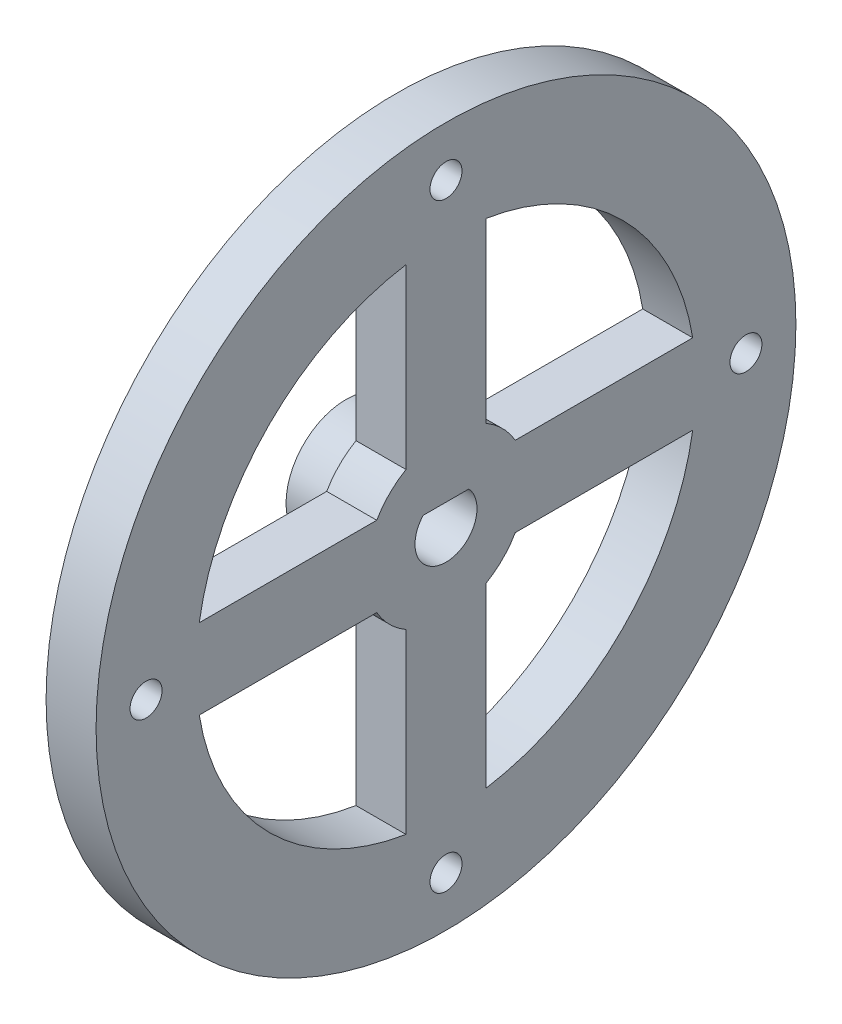
ISO-10303-21;
HEADER;
FILE_DESCRIPTION(('STEP AP214'),'2;1');
FILE_NAME('part.step','',(''),(''),'','','');
FILE_SCHEMA(('AUTOMOTIVE_DESIGN { 1 0 10303 214 1 1 1 1 }'));
ENDSEC;
DATA;
#1=APPLICATION_CONTEXT('core data for automotive mechanical design processes');
#2=APPLICATION_PROTOCOL_DEFINITION('international standard','automotive_design',2000,#1);
#3=PRODUCT_CONTEXT('',#1,'mechanical');
#4=PRODUCT('Part','Part','',(#3));
#5=PRODUCT_RELATED_PRODUCT_CATEGORY('part','',(#4));
#6=PRODUCT_DEFINITION_FORMATION('','',#4);
#7=PRODUCT_DEFINITION_CONTEXT('part definition',#1,'design');
#8=PRODUCT_DEFINITION('design','',#6,#7);
#9=PRODUCT_DEFINITION_SHAPE('','',#8);
#10=(LENGTH_UNIT() NAMED_UNIT(*) SI_UNIT(.MILLI.,.METRE.));
#11=(NAMED_UNIT(*) PLANE_ANGLE_UNIT() SI_UNIT($,.RADIAN.));
#12=(NAMED_UNIT(*) SI_UNIT($,.STERADIAN.) SOLID_ANGLE_UNIT());
#13=UNCERTAINTY_MEASURE_WITH_UNIT(LENGTH_MEASURE(1.E-05),#10,'distance_accuracy_value','');
#14=(GEOMETRIC_REPRESENTATION_CONTEXT(3) GLOBAL_UNCERTAINTY_ASSIGNED_CONTEXT((#13)) GLOBAL_UNIT_ASSIGNED_CONTEXT((#10,
#11,#12)) REPRESENTATION_CONTEXT('',''));
#15=CARTESIAN_POINT('',(0.,0.,0.));
#16=DIRECTION('',(0.,0.,1.));
#17=DIRECTION('',(1.,0.,0.));
#18=AXIS2_PLACEMENT_3D('',#15,#16,#17);
#19=CARTESIAN_POINT('',(5.,0.,0.));
#20=DIRECTION('',(-1.,0.,0.));
#21=DIRECTION('',(0.,0.,1.));
#22=AXIS2_PLACEMENT_3D('',#19,#20,#21);
#23=CYLINDRICAL_SURFACE('',#22,3.1);
#24=DIRECTION('',(-1.,0.,0.));
#25=VECTOR('',#24,1.);
#26=CARTESIAN_POINT('',(5.,2.1,-2.28035085019828));
#27=LINE('',#26,#25);
#28=CARTESIAN_POINT('',(5.,2.1,-2.28035085019828));
#29=VERTEX_POINT('',#28);
#30=CARTESIAN_POINT('',(-2.6124,2.1,-2.28035085019828));
#31=VERTEX_POINT('',#30);
#32=EDGE_CURVE('E487',#29,#31,#27,.T.);
#33=ORIENTED_EDGE('',*,*,#32,.T.);
#34=CARTESIAN_POINT('',(-2.6124,0.,0.));
#35=DIRECTION('',(-1.,0.,0.));
#36=DIRECTION('',(0.,0.,1.));
#37=AXIS2_PLACEMENT_3D('',#34,#35,#36);
#38=CIRCLE('',#37,3.1);
#39=CARTESIAN_POINT('',(-2.6124,2.1,2.28035085019828));
#40=VERTEX_POINT('',#39);
#41=EDGE_CURVE('E64',#31,#40,#38,.T.);
#42=ORIENTED_EDGE('',*,*,#41,.T.);
#43=DIRECTION('',(-1.,0.,0.));
#44=VECTOR('',#43,1.);
#45=CARTESIAN_POINT('',(5.,2.1,2.28035085019828));
#46=LINE('',#45,#44);
#47=CARTESIAN_POINT('',(5.,2.1,2.28035085019828));
#48=VERTEX_POINT('',#47);
#49=EDGE_CURVE('E483',#48,#40,#46,.T.);
#50=ORIENTED_EDGE('',*,*,#49,.F.);
#51=CARTESIAN_POINT('',(5.,0.,0.));
#52=DIRECTION('',(1.,0.,0.));
#53=DIRECTION('',(0.,0.,-1.));
#54=AXIS2_PLACEMENT_3D('',#51,#52,#53);
#55=CIRCLE('',#54,3.1);
#56=EDGE_CURVE('E476',#48,#29,#55,.T.);
#57=ORIENTED_EDGE('',*,*,#56,.T.);
#58=EDGE_LOOP('',(#33,#42,#50,#57));
#59=FACE_BOUND('',#58,.T.);
#60=ADVANCED_FACE('F49',(#59),#23,.F.);
#61=CARTESIAN_POINT('',(5.,2.1,-2.28035085019828));
#62=DIRECTION('',(0.,-1.,0.));
#63=DIRECTION('',(0.,0.,-1.));
#64=AXIS2_PLACEMENT_3D('',#61,#62,#63);
#65=PLANE('',#64);
#66=ORIENTED_EDGE('',*,*,#49,.T.);
#67=DIRECTION('',(0.,0.,-1.));
#68=VECTOR('',#67,1.);
#69=CARTESIAN_POINT('',(-2.6124,2.1,-2.28035085019828));
#70=LINE('',#69,#68);
#71=EDGE_CURVE('E11',#40,#31,#70,.T.);
#72=ORIENTED_EDGE('',*,*,#71,.T.);
#73=ORIENTED_EDGE('',*,*,#32,.F.);
#74=DIRECTION('',(0.,0.,1.));
#75=VECTOR('',#74,1.);
#76=CARTESIAN_POINT('',(5.,2.1,-2.28035085019828));
#77=LINE('',#76,#75);
#78=EDGE_CURVE('E480',#29,#48,#77,.T.);
#79=ORIENTED_EDGE('',*,*,#78,.T.);
#80=EDGE_LOOP('',(#66,#72,#73,#79));
#81=FACE_BOUND('',#80,.T.);
#82=ADVANCED_FACE('F531',(#81),#65,.T.);
#83=CARTESIAN_POINT('',(-5.,0.,0.));
#84=DIRECTION('',(-1.,0.,0.));
#85=DIRECTION('',(0.,0.,1.));
#86=AXIS2_PLACEMENT_3D('',#83,#84,#85);
#87=PLANE('',#86);
#88=CARTESIAN_POINT('',(-5.,0.,0.));
#89=DIRECTION('',(-1.,0.,0.));
#90=DIRECTION('',(0.,0.,1.));
#91=AXIS2_PLACEMENT_3D('',#88,#89,#90);
#92=CIRCLE('',#91,6.);
#93=CARTESIAN_POINT('',(-5.,0.,6.));
#94=VERTEX_POINT('',#93);
#95=EDGE_CURVE('E284',#94,#94,#92,.T.);
#96=ORIENTED_EDGE('',*,*,#95,.T.);
#97=EDGE_LOOP('',(#96));
#98=FACE_BOUND('',#97,.T.);
#99=CARTESIAN_POINT('',(-5.,0.,0.));
#100=DIRECTION('',(-1.,0.,0.));
#101=DIRECTION('',(0.,0.,1.));
#102=AXIS2_PLACEMENT_3D('',#99,#100,#101);
#103=CIRCLE('',#102,5.1181);
#104=CARTESIAN_POINT('',(-5.,3.30065645743389,3.9116));
#105=VERTEX_POINT('',#104);
#106=CARTESIAN_POINT('',(-5.,3.30065645743389,-3.9116));
#107=VERTEX_POINT('',#106);
#108=EDGE_CURVE('E208',#105,#107,#103,.T.);
#109=ORIENTED_EDGE('',*,*,#108,.F.);
#110=DIRECTION('',(0.,-1.,0.));
#111=VECTOR('',#110,1.);
#112=CARTESIAN_POINT('',(-5.,3.30065645743389,3.9116));
#113=LINE('',#112,#111);
#114=CARTESIAN_POINT('',(-5.,-3.30065645743389,3.9116));
#115=VERTEX_POINT('',#114);
#116=EDGE_CURVE('E71',#105,#115,#113,.T.);
#117=ORIENTED_EDGE('',*,*,#116,.T.);
#118=CARTESIAN_POINT('',(-5.,0.,0.));
#119=DIRECTION('',(-1.,0.,0.));
#120=DIRECTION('',(0.,0.,1.));
#121=AXIS2_PLACEMENT_3D('',#118,#119,#120);
#122=CIRCLE('',#121,5.1181);
#123=CARTESIAN_POINT('',(-5.,-3.30065645743389,-3.9116));
#124=VERTEX_POINT('',#123);
#125=EDGE_CURVE('E214',#124,#115,#122,.T.);
#126=ORIENTED_EDGE('',*,*,#125,.F.);
#127=DIRECTION('',(0.,1.,0.));
#128=VECTOR('',#127,1.);
#129=CARTESIAN_POINT('',(-5.,-3.30065645743389,-3.9116));
#130=LINE('',#129,#128);
#131=EDGE_CURVE('E236',#124,#107,#130,.T.);
#132=ORIENTED_EDGE('',*,*,#131,.T.);
#133=EDGE_LOOP('',(#109,#117,#126,#132));
#134=FACE_BOUND('',#133,.T.);
#135=ADVANCED_FACE('F522',(#98,#134),#87,.T.);
#136=CARTESIAN_POINT('',(5.,0.,-30.));
#137=DIRECTION('',(-1.,0.,0.));
#138=DIRECTION('',(0.,0.,1.));
#139=AXIS2_PLACEMENT_3D('',#136,#137,#138);
#140=CYLINDRICAL_SURFACE('',#139,1.6);
#141=CARTESIAN_POINT('',(5.,0.,-30.));
#142=DIRECTION('',(-1.,0.,0.));
#143=DIRECTION('',(0.,0.,1.));
#144=AXIS2_PLACEMENT_3D('',#141,#142,#143);
#145=CIRCLE('',#144,1.6);
#146=CARTESIAN_POINT('',(5.,0.,-28.4));
#147=VERTEX_POINT('',#146);
#148=EDGE_CURVE('E288',#147,#147,#145,.T.);
#149=ORIENTED_EDGE('',*,*,#148,.F.);
#150=EDGE_LOOP('',(#149));
#151=FACE_BOUND('',#150,.T.);
#152=CARTESIAN_POINT('',(2.,0.,-30.));
#153=DIRECTION('',(-1.,0.,0.));
#154=DIRECTION('',(0.,0.,1.));
#155=AXIS2_PLACEMENT_3D('',#152,#153,#154);
#156=CIRCLE('',#155,1.6);
#157=CARTESIAN_POINT('',(2.,0.,-28.4));
#158=VERTEX_POINT('',#157);
#159=EDGE_CURVE('E289',#158,#158,#156,.F.);
#160=ORIENTED_EDGE('',*,*,#159,.F.);
#161=EDGE_LOOP('',(#160));
#162=FACE_BOUND('',#161,.T.);
#163=ADVANCED_FACE('F519',(#151,#162),#140,.F.);
#164=CARTESIAN_POINT('',(5.,-30.,0.));
#165=DIRECTION('',(-1.,0.,0.));
#166=DIRECTION('',(0.,0.,1.));
#167=AXIS2_PLACEMENT_3D('',#164,#165,#166);
#168=CYLINDRICAL_SURFACE('',#167,1.6);
#169=CARTESIAN_POINT('',(5.,-30.,0.));
#170=DIRECTION('',(-1.,0.,0.));
#171=DIRECTION('',(0.,0.,1.));
#172=AXIS2_PLACEMENT_3D('',#169,#170,#171);
#173=CIRCLE('',#172,1.6);
#174=CARTESIAN_POINT('',(5.,-30.,1.60000000000001));
#175=VERTEX_POINT('',#174);
#176=EDGE_CURVE('E299',#175,#175,#173,.T.);
#177=ORIENTED_EDGE('',*,*,#176,.F.);
#178=EDGE_LOOP('',(#177));
#179=FACE_BOUND('',#178,.T.);
#180=CARTESIAN_POINT('',(2.,-30.,0.));
#181=DIRECTION('',(-1.,0.,0.));
#182=DIRECTION('',(0.,0.,1.));
#183=AXIS2_PLACEMENT_3D('',#180,#181,#182);
#184=CIRCLE('',#183,1.6);
#185=CARTESIAN_POINT('',(2.,-30.,1.60000000000001));
#186=VERTEX_POINT('',#185);
#187=EDGE_CURVE('E509',#186,#186,#184,.F.);
#188=ORIENTED_EDGE('',*,*,#187,.F.);
#189=EDGE_LOOP('',(#188));
#190=FACE_BOUND('',#189,.T.);
#191=ADVANCED_FACE('F521',(#179,#190),#168,.F.);
#192=CARTESIAN_POINT('',(5.,0.,30.));
#193=DIRECTION('',(-1.,0.,0.));
#194=DIRECTION('',(0.,0.,1.));
#195=AXIS2_PLACEMENT_3D('',#192,#193,#194);
#196=CYLINDRICAL_SURFACE('',#195,1.60000000000001);
#197=CARTESIAN_POINT('',(5.,0.,30.));
#198=DIRECTION('',(-1.,0.,0.));
#199=DIRECTION('',(0.,0.,1.));
#200=AXIS2_PLACEMENT_3D('',#197,#198,#199);
#201=CIRCLE('',#200,1.60000000000001);
#202=CARTESIAN_POINT('',(5.,0.,31.6));
#203=VERTEX_POINT('',#202);
#204=EDGE_CURVE('E295',#203,#203,#201,.T.);
#205=ORIENTED_EDGE('',*,*,#204,.F.);
#206=EDGE_LOOP('',(#205));
#207=FACE_BOUND('',#206,.T.);
#208=CARTESIAN_POINT('',(2.,0.,30.));
#209=DIRECTION('',(-1.,0.,0.));
#210=DIRECTION('',(0.,0.,1.));
#211=AXIS2_PLACEMENT_3D('',#208,#209,#210);
#212=CIRCLE('',#211,1.60000000000001);
#213=CARTESIAN_POINT('',(2.,0.,31.6));
#214=VERTEX_POINT('',#213);
#215=EDGE_CURVE('E505',#214,#214,#212,.F.);
#216=ORIENTED_EDGE('',*,*,#215,.F.);
#217=EDGE_LOOP('',(#216));
#218=FACE_BOUND('',#217,.T.);
#219=ADVANCED_FACE('F528',(#207,#218),#196,.F.);
#220=CARTESIAN_POINT('',(5.,30.,0.));
#221=DIRECTION('',(-1.,0.,0.));
#222=DIRECTION('',(0.,0.,1.));
#223=AXIS2_PLACEMENT_3D('',#220,#221,#222);
#224=CYLINDRICAL_SURFACE('',#223,1.6);
#225=CARTESIAN_POINT('',(5.,30.,0.));
#226=DIRECTION('',(-1.,0.,0.));
#227=DIRECTION('',(0.,0.,1.));
#228=AXIS2_PLACEMENT_3D('',#225,#226,#227);
#229=CIRCLE('',#228,1.6);
#230=CARTESIAN_POINT('',(5.,30.,1.6));
#231=VERTEX_POINT('',#230);
#232=EDGE_CURVE('E290',#231,#231,#229,.T.);
#233=ORIENTED_EDGE('',*,*,#232,.F.);
#234=EDGE_LOOP('',(#233));
#235=FACE_BOUND('',#234,.T.);
#236=CARTESIAN_POINT('',(2.,30.,0.));
#237=DIRECTION('',(-1.,0.,0.));
#238=DIRECTION('',(0.,0.,1.));
#239=AXIS2_PLACEMENT_3D('',#236,#237,#238);
#240=CIRCLE('',#239,1.6);
#241=CARTESIAN_POINT('',(2.,30.,1.6));
#242=VERTEX_POINT('',#241);
#243=EDGE_CURVE('E256',#242,#242,#240,.F.);
#244=ORIENTED_EDGE('',*,*,#243,.F.);
#245=EDGE_LOOP('',(#244));
#246=FACE_BOUND('',#245,.T.);
#247=ADVANCED_FACE('F550',(#235,#246),#224,.F.);
#248=CARTESIAN_POINT('',(0.,0.,0.));
#249=DIRECTION('',(1.,0.,0.));
#250=DIRECTION('',(0.,0.,-1.));
#251=AXIS2_PLACEMENT_3D('',#248,#249,#250);
#252=PLANE('',#251);
#253=CARTESIAN_POINT('',(0.,30.,0.));
#254=DIRECTION('',(-1.,0.,0.));
#255=DIRECTION('',(0.,0.,1.));
#256=AXIS2_PLACEMENT_3D('',#253,#254,#255);
#257=CIRCLE('',#256,4.);
#258=CARTESIAN_POINT('',(0.,30.,4.));
#259=VERTEX_POINT('',#258);
#260=EDGE_CURVE('E257',#259,#259,#257,.T.);
#261=ORIENTED_EDGE('',*,*,#260,.F.);
#262=EDGE_LOOP('',(#261));
#263=FACE_BOUND('',#262,.T.);
#264=CARTESIAN_POINT('',(0.,0.,30.));
#265=DIRECTION('',(-1.,0.,0.));
#266=DIRECTION('',(0.,0.,1.));
#267=AXIS2_PLACEMENT_3D('',#264,#265,#266);
#268=CIRCLE('',#267,4.00000000000001);
#269=CARTESIAN_POINT('',(0.,0.,34.));
#270=VERTEX_POINT('',#269);
#271=EDGE_CURVE('E261',#270,#270,#268,.T.);
#272=ORIENTED_EDGE('',*,*,#271,.F.);
#273=EDGE_LOOP('',(#272));
#274=FACE_BOUND('',#273,.T.);
#275=CARTESIAN_POINT('',(0.,-30.,0.));
#276=DIRECTION('',(-1.,0.,0.));
#277=DIRECTION('',(0.,0.,1.));
#278=AXIS2_PLACEMENT_3D('',#275,#276,#277);
#279=CIRCLE('',#278,4.);
#280=CARTESIAN_POINT('',(0.,-30.,4.));
#281=VERTEX_POINT('',#280);
#282=EDGE_CURVE('E269',#281,#281,#279,.T.);
#283=ORIENTED_EDGE('',*,*,#282,.F.);
#284=EDGE_LOOP('',(#283));
#285=FACE_BOUND('',#284,.T.);
#286=CARTESIAN_POINT('',(0.,0.,-30.));
#287=DIRECTION('',(-1.,0.,0.));
#288=DIRECTION('',(0.,0.,1.));
#289=AXIS2_PLACEMENT_3D('',#286,#287,#288);
#290=CIRCLE('',#289,4.);
#291=CARTESIAN_POINT('',(0.,0.,-26.));
#292=VERTEX_POINT('',#291);
#293=EDGE_CURVE('E277',#292,#292,#290,.T.);
#294=ORIENTED_EDGE('',*,*,#293,.F.);
#295=EDGE_LOOP('',(#294));
#296=FACE_BOUND('',#295,.T.);
#297=CARTESIAN_POINT('',(0.,0.,0.));
#298=DIRECTION('',(1.,0.,0.));
#299=DIRECTION('',(0.,0.,-1.));
#300=AXIS2_PLACEMENT_3D('',#297,#298,#299);
#301=CIRCLE('',#300,25.);
#302=CARTESIAN_POINT('',(0.,-24.6779253585061,-4.));
#303=VERTEX_POINT('',#302);
#304=CARTESIAN_POINT('',(0.,-4.00000000000001,-24.6779253585061));
#305=VERTEX_POINT('',#304);
#306=EDGE_CURVE('E294',#303,#305,#301,.T.);
#307=ORIENTED_EDGE('',*,*,#306,.T.);
#308=DIRECTION('',(0.,0.,1.));
#309=VECTOR('',#308,1.);
#310=CARTESIAN_POINT('',(0.,-4.,-6.92820323027551));
#311=LINE('',#310,#309);
#312=CARTESIAN_POINT('',(0.,-4.,-6.92820323027551));
#313=VERTEX_POINT('',#312);
#314=EDGE_CURVE('E324',#305,#313,#311,.T.);
#315=ORIENTED_EDGE('',*,*,#314,.T.);
#316=CARTESIAN_POINT('',(0.,0.,0.));
#317=DIRECTION('',(-1.,0.,0.));
#318=DIRECTION('',(0.,0.,-1.));
#319=AXIS2_PLACEMENT_3D('',#316,#317,#318);
#320=CIRCLE('',#319,8.);
#321=CARTESIAN_POINT('',(0.,-6.92820323027551,-4.));
#322=VERTEX_POINT('',#321);
#323=EDGE_CURVE('E328',#313,#322,#320,.T.);
#324=ORIENTED_EDGE('',*,*,#323,.T.);
#325=DIRECTION('',(0.,-1.,0.));
#326=VECTOR('',#325,1.);
#327=CARTESIAN_POINT('',(0.,-24.6779253585061,-4.));
#328=LINE('',#327,#326);
#329=EDGE_CURVE('E310',#322,#303,#328,.T.);
#330=ORIENTED_EDGE('',*,*,#329,.T.);
#331=EDGE_LOOP('',(#307,#315,#324,#330));
#332=FACE_BOUND('',#331,.T.);
#333=CARTESIAN_POINT('',(0.,0.,0.));
#334=DIRECTION('',(1.,0.,0.));
#335=DIRECTION('',(0.,0.,1.));
#336=AXIS2_PLACEMENT_3D('',#333,#334,#335);
#337=CIRCLE('',#336,25.);
#338=CARTESIAN_POINT('',(0.,24.6779253585061,4.));
#339=VERTEX_POINT('',#338);
#340=CARTESIAN_POINT('',(0.,4.,24.6779253585061));
#341=VERTEX_POINT('',#340);
#342=EDGE_CURVE('E390',#339,#341,#337,.T.);
#343=ORIENTED_EDGE('',*,*,#342,.T.);
#344=DIRECTION('',(0.,0.,-1.));
#345=VECTOR('',#344,1.);
#346=CARTESIAN_POINT('',(0.,4.,6.92820323027551));
#347=LINE('',#346,#345);
#348=CARTESIAN_POINT('',(0.,4.,6.92820323027551));
#349=VERTEX_POINT('',#348);
#350=EDGE_CURVE('E409',#341,#349,#347,.T.);
#351=ORIENTED_EDGE('',*,*,#350,.T.);
#352=CARTESIAN_POINT('',(0.,0.,0.));
#353=DIRECTION('',(-1.,0.,0.));
#354=DIRECTION('',(0.,0.,-1.));
#355=AXIS2_PLACEMENT_3D('',#352,#353,#354);
#356=CIRCLE('',#355,8.);
#357=CARTESIAN_POINT('',(0.,6.92820323027551,4.));
#358=VERTEX_POINT('',#357);
#359=EDGE_CURVE('E413',#349,#358,#356,.T.);
#360=ORIENTED_EDGE('',*,*,#359,.T.);
#361=DIRECTION('',(0.,1.,0.));
#362=VECTOR('',#361,1.);
#363=CARTESIAN_POINT('',(0.,24.6779253585061,4.));
#364=LINE('',#363,#362);
#365=EDGE_CURVE('E395',#358,#339,#364,.T.);
#366=ORIENTED_EDGE('',*,*,#365,.T.);
#367=EDGE_LOOP('',(#343,#351,#360,#366));
#368=FACE_BOUND('',#367,.T.);
#369=CARTESIAN_POINT('',(0.,0.,0.));
#370=DIRECTION('',(1.,0.,0.));
#371=DIRECTION('',(0.,0.,-1.));
#372=AXIS2_PLACEMENT_3D('',#369,#370,#371);
#373=CIRCLE('',#372,35.);
#374=CARTESIAN_POINT('',(0.,0.,-35.));
#375=VERTEX_POINT('',#374);
#376=EDGE_CURVE('E491',#375,#375,#373,.T.);
#377=ORIENTED_EDGE('',*,*,#376,.F.);
#378=EDGE_LOOP('',(#377));
#379=FACE_BOUND('',#378,.T.);
#380=CARTESIAN_POINT('',(0.,0.,0.));
#381=DIRECTION('',(-1.,0.,0.));
#382=DIRECTION('',(0.,0.,-1.));
#383=AXIS2_PLACEMENT_3D('',#380,#381,#382);
#384=CIRCLE('',#383,8.);
#385=CARTESIAN_POINT('',(0.,6.92820323027551,-4.));
#386=VERTEX_POINT('',#385);
#387=CARTESIAN_POINT('',(0.,4.,-6.92820323027551));
#388=VERTEX_POINT('',#387);
#389=EDGE_CURVE('E433',#386,#388,#384,.T.);
#390=ORIENTED_EDGE('',*,*,#389,.T.);
#391=DIRECTION('',(0.,0.,-1.));
#392=VECTOR('',#391,1.);
#393=CARTESIAN_POINT('',(0.,3.99999999999999,-24.6779253585061));
#394=LINE('',#393,#392);
#395=CARTESIAN_POINT('',(0.,3.99999999999999,-24.6779253585061));
#396=VERTEX_POINT('',#395);
#397=EDGE_CURVE('E452',#388,#396,#394,.T.);
#398=ORIENTED_EDGE('',*,*,#397,.T.);
#399=CARTESIAN_POINT('',(0.,0.,0.));
#400=DIRECTION('',(1.,0.,0.));
#401=DIRECTION('',(0.,0.,-1.));
#402=AXIS2_PLACEMENT_3D('',#399,#400,#401);
#403=CIRCLE('',#402,25.);
#404=CARTESIAN_POINT('',(0.,24.6779253585061,-4.));
#405=VERTEX_POINT('',#404);
#406=EDGE_CURVE('E456',#396,#405,#403,.T.);
#407=ORIENTED_EDGE('',*,*,#406,.T.);
#408=DIRECTION('',(0.,-1.,0.));
#409=VECTOR('',#408,1.);
#410=CARTESIAN_POINT('',(0.,6.92820323027551,-4.));
#411=LINE('',#410,#409);
#412=EDGE_CURVE('E438',#405,#386,#411,.T.);
#413=ORIENTED_EDGE('',*,*,#412,.T.);
#414=EDGE_LOOP('',(#390,#398,#407,#413));
#415=FACE_BOUND('',#414,.T.);
#416=CARTESIAN_POINT('',(0.,0.,0.));
#417=DIRECTION('',(1.,0.,0.));
#418=DIRECTION('',(0.,0.,-1.));
#419=AXIS2_PLACEMENT_3D('',#416,#417,#418);
#420=CIRCLE('',#419,25.);
#421=CARTESIAN_POINT('',(0.,-4.,24.6779253585061));
#422=VERTEX_POINT('',#421);
#423=CARTESIAN_POINT('',(0.,-24.6779253585061,4.));
#424=VERTEX_POINT('',#423);
#425=EDGE_CURVE('E347',#422,#424,#420,.T.);
#426=ORIENTED_EDGE('',*,*,#425,.T.);
#427=DIRECTION('',(0.,1.,0.));
#428=VECTOR('',#427,1.);
#429=CARTESIAN_POINT('',(0.,-6.92820323027551,4.));
#430=LINE('',#429,#428);
#431=CARTESIAN_POINT('',(0.,-6.92820323027551,4.));
#432=VERTEX_POINT('',#431);
#433=EDGE_CURVE('E366',#424,#432,#430,.T.);
#434=ORIENTED_EDGE('',*,*,#433,.T.);
#435=CARTESIAN_POINT('',(0.,0.,0.));
#436=DIRECTION('',(-1.,0.,0.));
#437=DIRECTION('',(0.,0.,-1.));
#438=AXIS2_PLACEMENT_3D('',#435,#436,#437);
#439=CIRCLE('',#438,8.);
#440=CARTESIAN_POINT('',(0.,-4.,6.92820323027551));
#441=VERTEX_POINT('',#440);
#442=EDGE_CURVE('E370',#432,#441,#439,.T.);
#443=ORIENTED_EDGE('',*,*,#442,.T.);
#444=DIRECTION('',(0.,0.,1.));
#445=VECTOR('',#444,1.);
#446=CARTESIAN_POINT('',(0.,-4.,24.6779253585061));
#447=LINE('',#446,#445);
#448=EDGE_CURVE('E352',#441,#422,#447,.T.);
#449=ORIENTED_EDGE('',*,*,#448,.T.);
#450=EDGE_LOOP('',(#426,#434,#443,#449));
#451=FACE_BOUND('',#450,.T.);
#452=CARTESIAN_POINT('',(0.,0.,0.));
#453=DIRECTION('',(1.,0.,0.));
#454=DIRECTION('',(0.,0.,-1.));
#455=AXIS2_PLACEMENT_3D('',#452,#453,#454);
#456=CIRCLE('',#455,6.);
#457=CARTESIAN_POINT('',(0.,0.,-6.));
#458=VERTEX_POINT('',#457);
#459=EDGE_CURVE('E58',#458,#458,#456,.F.);
#460=ORIENTED_EDGE('',*,*,#459,.F.);
#461=EDGE_LOOP('',(#460));
#462=FACE_BOUND('',#461,.T.);
#463=ADVANCED_FACE('F547',(#263,#274,#285,#296,#332,#368,#379,#415,#451,#462),#252,.F.);
#464=CARTESIAN_POINT('',(5.,0.,0.));
#465=DIRECTION('',(1.,0.,0.));
#466=DIRECTION('',(0.,0.,-1.));
#467=AXIS2_PLACEMENT_3D('',#464,#465,#466);
#468=PLANE('',#467);
#469=ORIENTED_EDGE('',*,*,#232,.T.);
#470=EDGE_LOOP('',(#469));
#471=FACE_BOUND('',#470,.T.);
#472=ORIENTED_EDGE('',*,*,#204,.T.);
#473=EDGE_LOOP('',(#472));
#474=FACE_BOUND('',#473,.T.);
#475=ORIENTED_EDGE('',*,*,#176,.T.);
#476=EDGE_LOOP('',(#475));
#477=FACE_BOUND('',#476,.T.);
#478=ORIENTED_EDGE('',*,*,#148,.T.);
#479=EDGE_LOOP('',(#478));
#480=FACE_BOUND('',#479,.T.);
#481=CARTESIAN_POINT('',(5.,0.,0.));
#482=DIRECTION('',(1.,0.,0.));
#483=DIRECTION('',(0.,0.,-1.));
#484=AXIS2_PLACEMENT_3D('',#481,#482,#483);
#485=CIRCLE('',#484,35.);
#486=CARTESIAN_POINT('',(5.,0.,-35.));
#487=VERTEX_POINT('',#486);
#488=EDGE_CURVE('E492',#487,#487,#485,.T.);
#489=ORIENTED_EDGE('',*,*,#488,.T.);
#490=EDGE_LOOP('',(#489));
#491=FACE_BOUND('',#490,.T.);
#492=ORIENTED_EDGE('',*,*,#78,.F.);
#493=ORIENTED_EDGE('',*,*,#56,.F.);
#494=EDGE_LOOP('',(#492,#493));
#495=FACE_BOUND('',#494,.T.);
#496=DIRECTION('',(0.,0.,-1.));
#497=VECTOR('',#496,1.);
#498=CARTESIAN_POINT('',(5.,3.99999999999999,-24.6779253585061));
#499=LINE('',#498,#497);
#500=CARTESIAN_POINT('',(5.,4.,-6.92820323027551));
#501=VERTEX_POINT('',#500);
#502=CARTESIAN_POINT('',(5.,3.99999999999999,-24.6779253585061));
#503=VERTEX_POINT('',#502);
#504=EDGE_CURVE('E437',#501,#503,#499,.T.);
#505=ORIENTED_EDGE('',*,*,#504,.F.);
#506=CARTESIAN_POINT('',(5.,0.,0.));
#507=DIRECTION('',(-1.,0.,0.));
#508=DIRECTION('',(0.,0.,-1.));
#509=AXIS2_PLACEMENT_3D('',#506,#507,#508);
#510=CIRCLE('',#509,8.);
#511=CARTESIAN_POINT('',(5.,6.92820323027551,-4.));
#512=VERTEX_POINT('',#511);
#513=EDGE_CURVE('E434',#512,#501,#510,.T.);
#514=ORIENTED_EDGE('',*,*,#513,.F.);
#515=DIRECTION('',(0.,-1.,0.));
#516=VECTOR('',#515,1.);
#517=CARTESIAN_POINT('',(5.,6.92820323027551,-4.));
#518=LINE('',#517,#516);
#519=CARTESIAN_POINT('',(5.,24.6779253585061,-4.));
#520=VERTEX_POINT('',#519);
#521=EDGE_CURVE('E445',#520,#512,#518,.T.);
#522=ORIENTED_EDGE('',*,*,#521,.F.);
#523=CARTESIAN_POINT('',(5.,0.,0.));
#524=DIRECTION('',(1.,0.,0.));
#525=DIRECTION('',(0.,0.,-1.));
#526=AXIS2_PLACEMENT_3D('',#523,#524,#525);
#527=CIRCLE('',#526,25.);
#528=EDGE_CURVE('E441',#503,#520,#527,.T.);
#529=ORIENTED_EDGE('',*,*,#528,.F.);
#530=EDGE_LOOP('',(#505,#514,#522,#529));
#531=FACE_BOUND('',#530,.T.);
#532=DIRECTION('',(0.,0.,-1.));
#533=VECTOR('',#532,1.);
#534=CARTESIAN_POINT('',(5.,4.,6.92820323027551));
#535=LINE('',#534,#533);
#536=CARTESIAN_POINT('',(5.,4.,24.6779253585061));
#537=VERTEX_POINT('',#536);
#538=CARTESIAN_POINT('',(5.,4.,6.92820323027551));
#539=VERTEX_POINT('',#538);
#540=EDGE_CURVE('E394',#537,#539,#535,.T.);
#541=ORIENTED_EDGE('',*,*,#540,.F.);
#542=CARTESIAN_POINT('',(5.,0.,0.));
#543=DIRECTION('',(1.,0.,0.));
#544=DIRECTION('',(0.,0.,1.));
#545=AXIS2_PLACEMENT_3D('',#542,#543,#544);
#546=CIRCLE('',#545,25.);
#547=CARTESIAN_POINT('',(5.,24.6779253585061,4.));
#548=VERTEX_POINT('',#547);
#549=EDGE_CURVE('E391',#548,#537,#546,.T.);
#550=ORIENTED_EDGE('',*,*,#549,.F.);
#551=DIRECTION('',(0.,1.,0.));
#552=VECTOR('',#551,1.);
#553=CARTESIAN_POINT('',(5.,24.6779253585061,4.));
#554=LINE('',#553,#552);
#555=CARTESIAN_POINT('',(5.,6.92820323027551,4.));
#556=VERTEX_POINT('',#555);
#557=EDGE_CURVE('E402',#556,#548,#554,.T.);
#558=ORIENTED_EDGE('',*,*,#557,.F.);
#559=CARTESIAN_POINT('',(5.,0.,0.));
#560=DIRECTION('',(-1.,0.,0.));
#561=DIRECTION('',(0.,0.,-1.));
#562=AXIS2_PLACEMENT_3D('',#559,#560,#561);
#563=CIRCLE('',#562,8.);
#564=EDGE_CURVE('E398',#539,#556,#563,.T.);
#565=ORIENTED_EDGE('',*,*,#564,.F.);
#566=EDGE_LOOP('',(#541,#550,#558,#565));
#567=FACE_BOUND('',#566,.T.);
#568=DIRECTION('',(0.,1.,0.));
#569=VECTOR('',#568,1.);
#570=CARTESIAN_POINT('',(5.,-6.92820323027551,4.));
#571=LINE('',#570,#569);
#572=CARTESIAN_POINT('',(5.,-24.6779253585061,4.));
#573=VERTEX_POINT('',#572);
#574=CARTESIAN_POINT('',(5.,-6.92820323027551,4.));
#575=VERTEX_POINT('',#574);
#576=EDGE_CURVE('E351',#573,#575,#571,.T.);
#577=ORIENTED_EDGE('',*,*,#576,.F.);
#578=CARTESIAN_POINT('',(5.,0.,0.));
#579=DIRECTION('',(1.,0.,0.));
#580=DIRECTION('',(0.,0.,-1.));
#581=AXIS2_PLACEMENT_3D('',#578,#579,#580);
#582=CIRCLE('',#581,25.);
#583=CARTESIAN_POINT('',(5.,-4.,24.6779253585061));
#584=VERTEX_POINT('',#583);
#585=EDGE_CURVE('E348',#584,#573,#582,.T.);
#586=ORIENTED_EDGE('',*,*,#585,.F.);
#587=DIRECTION('',(0.,0.,1.));
#588=VECTOR('',#587,1.);
#589=CARTESIAN_POINT('',(5.,-4.,24.6779253585061));
#590=LINE('',#589,#588);
#591=CARTESIAN_POINT('',(5.,-4.,6.92820323027551));
#592=VERTEX_POINT('',#591);
#593=EDGE_CURVE('E359',#592,#584,#590,.T.);
#594=ORIENTED_EDGE('',*,*,#593,.F.);
#595=CARTESIAN_POINT('',(5.,0.,0.));
#596=DIRECTION('',(-1.,0.,0.));
#597=DIRECTION('',(0.,0.,-1.));
#598=AXIS2_PLACEMENT_3D('',#595,#596,#597);
#599=CIRCLE('',#598,8.);
#600=EDGE_CURVE('E355',#575,#592,#599,.T.);
#601=ORIENTED_EDGE('',*,*,#600,.F.);
#602=EDGE_LOOP('',(#577,#586,#594,#601));
#603=FACE_BOUND('',#602,.T.);
#604=DIRECTION('',(0.,0.,1.));
#605=VECTOR('',#604,1.);
#606=CARTESIAN_POINT('',(5.,-4.,-6.92820323027551));
#607=LINE('',#606,#605);
#608=CARTESIAN_POINT('',(5.,-4.00000000000001,-24.6779253585061));
#609=VERTEX_POINT('',#608);
#610=CARTESIAN_POINT('',(5.,-4.,-6.92820323027551));
#611=VERTEX_POINT('',#610);
#612=EDGE_CURVE('E309',#609,#611,#607,.T.);
#613=ORIENTED_EDGE('',*,*,#612,.F.);
#614=CARTESIAN_POINT('',(5.,0.,0.));
#615=DIRECTION('',(1.,0.,0.));
#616=DIRECTION('',(0.,0.,-1.));
#617=AXIS2_PLACEMENT_3D('',#614,#615,#616);
#618=CIRCLE('',#617,25.);
#619=CARTESIAN_POINT('',(5.,-24.6779253585061,-4.));
#620=VERTEX_POINT('',#619);
#621=EDGE_CURVE('E306',#620,#609,#618,.T.);
#622=ORIENTED_EDGE('',*,*,#621,.F.);
#623=DIRECTION('',(0.,-1.,0.));
#624=VECTOR('',#623,1.);
#625=CARTESIAN_POINT('',(5.,-24.6779253585061,-4.));
#626=LINE('',#625,#624);
#627=CARTESIAN_POINT('',(5.,-6.92820323027551,-4.));
#628=VERTEX_POINT('',#627);
#629=EDGE_CURVE('E317',#628,#620,#626,.T.);
#630=ORIENTED_EDGE('',*,*,#629,.F.);
#631=CARTESIAN_POINT('',(5.,0.,0.));
#632=DIRECTION('',(-1.,0.,0.));
#633=DIRECTION('',(0.,0.,-1.));
#634=AXIS2_PLACEMENT_3D('',#631,#632,#633);
#635=CIRCLE('',#634,8.);
#636=EDGE_CURVE('E313',#611,#628,#635,.T.);
#637=ORIENTED_EDGE('',*,*,#636,.F.);
#638=EDGE_LOOP('',(#613,#622,#630,#637));
#639=FACE_BOUND('',#638,.T.);
#640=ADVANCED_FACE('F545',(#471,#474,#477,#480,#491,#495,#531,#567,#603,#639),#468,.T.);
#641=CARTESIAN_POINT('',(5.,0.,0.));
#642=DIRECTION('',(-1.,0.,0.));
#643=DIRECTION('',(0.,0.,1.));
#644=AXIS2_PLACEMENT_3D('',#641,#642,#643);
#645=CYLINDRICAL_SURFACE('',#644,35.);
#646=ORIENTED_EDGE('',*,*,#488,.F.);
#647=EDGE_LOOP('',(#646));
#648=FACE_BOUND('',#647,.T.);
#649=ORIENTED_EDGE('',*,*,#376,.T.);
#650=EDGE_LOOP('',(#649));
#651=FACE_BOUND('',#650,.T.);
#652=ADVANCED_FACE('F51',(#648,#651),#645,.T.);
#653=CARTESIAN_POINT('',(5.,0.,0.));
#654=DIRECTION('',(-1.,0.,0.));
#655=DIRECTION('',(0.,0.,1.));
#656=AXIS2_PLACEMENT_3D('',#653,#654,#655);
#657=CYLINDRICAL_SURFACE('',#656,8.);
#658=ORIENTED_EDGE('',*,*,#389,.F.);
#659=DIRECTION('',(-1.,0.,0.));
#660=VECTOR('',#659,1.);
#661=CARTESIAN_POINT('',(5.,6.92820323027551,-4.));
#662=LINE('',#661,#660);
#663=EDGE_CURVE('E448',#512,#386,#662,.T.);
#664=ORIENTED_EDGE('',*,*,#663,.F.);
#665=ORIENTED_EDGE('',*,*,#513,.T.);
#666=DIRECTION('',(-1.,0.,0.));
#667=VECTOR('',#666,1.);
#668=CARTESIAN_POINT('',(5.,4.,-6.92820323027551));
#669=LINE('',#668,#667);
#670=EDGE_CURVE('E472',#501,#388,#669,.T.);
#671=ORIENTED_EDGE('',*,*,#670,.T.);
#672=EDGE_LOOP('',(#658,#664,#665,#671));
#673=FACE_BOUND('',#672,.T.);
#674=ADVANCED_FACE('F924',(#673),#657,.T.);
#675=CARTESIAN_POINT('',(5.,3.99999999999999,-24.6779253585061));
#676=DIRECTION('',(0.,1.,0.));
#677=DIRECTION('',(0.,0.,1.));
#678=AXIS2_PLACEMENT_3D('',#675,#676,#677);
#679=PLANE('',#678);
#680=ORIENTED_EDGE('',*,*,#397,.F.);
#681=ORIENTED_EDGE('',*,*,#670,.F.);
#682=ORIENTED_EDGE('',*,*,#504,.T.);
#683=DIRECTION('',(-1.,0.,0.));
#684=VECTOR('',#683,1.);
#685=CARTESIAN_POINT('',(5.,3.99999999999999,-24.6779253585061));
#686=LINE('',#685,#684);
#687=EDGE_CURVE('E469',#503,#396,#686,.T.);
#688=ORIENTED_EDGE('',*,*,#687,.T.);
#689=EDGE_LOOP('',(#680,#681,#682,#688));
#690=FACE_BOUND('',#689,.T.);
#691=ADVANCED_FACE('F914',(#690),#679,.T.);
#692=CARTESIAN_POINT('',(5.,0.,0.));
#693=DIRECTION('',(-1.,0.,0.));
#694=DIRECTION('',(0.,0.,1.));
#695=AXIS2_PLACEMENT_3D('',#692,#693,#694);
#696=CYLINDRICAL_SURFACE('',#695,25.);
#697=ORIENTED_EDGE('',*,*,#406,.F.);
#698=ORIENTED_EDGE('',*,*,#687,.F.);
#699=ORIENTED_EDGE('',*,*,#528,.T.);
#700=DIRECTION('',(-1.,0.,0.));
#701=VECTOR('',#700,1.);
#702=CARTESIAN_POINT('',(5.,24.6779253585061,-4.));
#703=LINE('',#702,#701);
#704=EDGE_CURVE('E466',#520,#405,#703,.T.);
#705=ORIENTED_EDGE('',*,*,#704,.T.);
#706=EDGE_LOOP('',(#697,#698,#699,#705));
#707=FACE_BOUND('',#706,.T.);
#708=ADVANCED_FACE('F904',(#707),#696,.F.);
#709=CARTESIAN_POINT('',(5.,6.92820323027551,-4.));
#710=DIRECTION('',(0.,0.,-1.));
#711=DIRECTION('',(0.,1.,0.));
#712=AXIS2_PLACEMENT_3D('',#709,#710,#711);
#713=PLANE('',#712);
#714=ORIENTED_EDGE('',*,*,#412,.F.);
#715=ORIENTED_EDGE('',*,*,#704,.F.);
#716=ORIENTED_EDGE('',*,*,#521,.T.);
#717=ORIENTED_EDGE('',*,*,#663,.T.);
#718=EDGE_LOOP('',(#714,#715,#716,#717));
#719=FACE_BOUND('',#718,.T.);
#720=ADVANCED_FACE('F894',(#719),#713,.T.);
#721=CARTESIAN_POINT('',(5.,0.,0.));
#722=DIRECTION('',(-1.,0.,0.));
#723=DIRECTION('',(0.,0.,1.));
#724=AXIS2_PLACEMENT_3D('',#721,#722,#723);
#725=CYLINDRICAL_SURFACE('',#724,25.);
#726=ORIENTED_EDGE('',*,*,#342,.F.);
#727=DIRECTION('',(-1.,0.,0.));
#728=VECTOR('',#727,1.);
#729=CARTESIAN_POINT('',(5.,24.6779253585061,4.));
#730=LINE('',#729,#728);
#731=EDGE_CURVE('E405',#548,#339,#730,.T.);
#732=ORIENTED_EDGE('',*,*,#731,.F.);
#733=ORIENTED_EDGE('',*,*,#549,.T.);
#734=DIRECTION('',(-1.,0.,0.));
#735=VECTOR('',#734,1.);
#736=CARTESIAN_POINT('',(5.,4.,24.6779253585061));
#737=LINE('',#736,#735);
#738=EDGE_CURVE('E429',#537,#341,#737,.T.);
#739=ORIENTED_EDGE('',*,*,#738,.T.);
#740=EDGE_LOOP('',(#726,#732,#733,#739));
#741=FACE_BOUND('',#740,.T.);
#742=ADVANCED_FACE('F884',(#741),#725,.F.);
#743=CARTESIAN_POINT('',(5.,4.,6.92820323027551));
#744=DIRECTION('',(0.,1.,0.));
#745=DIRECTION('',(0.,0.,1.));
#746=AXIS2_PLACEMENT_3D('',#743,#744,#745);
#747=PLANE('',#746);
#748=ORIENTED_EDGE('',*,*,#350,.F.);
#749=ORIENTED_EDGE('',*,*,#738,.F.);
#750=ORIENTED_EDGE('',*,*,#540,.T.);
#751=DIRECTION('',(-1.,0.,0.));
#752=VECTOR('',#751,1.);
#753=CARTESIAN_POINT('',(5.,4.,6.92820323027551));
#754=LINE('',#753,#752);
#755=EDGE_CURVE('E426',#539,#349,#754,.T.);
#756=ORIENTED_EDGE('',*,*,#755,.T.);
#757=EDGE_LOOP('',(#748,#749,#750,#756));
#758=FACE_BOUND('',#757,.T.);
#759=ADVANCED_FACE('F874',(#758),#747,.T.);
#760=CARTESIAN_POINT('',(5.,0.,0.));
#761=DIRECTION('',(-1.,0.,0.));
#762=DIRECTION('',(0.,0.,1.));
#763=AXIS2_PLACEMENT_3D('',#760,#761,#762);
#764=CYLINDRICAL_SURFACE('',#763,8.);
#765=ORIENTED_EDGE('',*,*,#359,.F.);
#766=ORIENTED_EDGE('',*,*,#755,.F.);
#767=ORIENTED_EDGE('',*,*,#564,.T.);
#768=DIRECTION('',(-1.,0.,0.));
#769=VECTOR('',#768,1.);
#770=CARTESIAN_POINT('',(5.,6.92820323027551,4.));
#771=LINE('',#770,#769);
#772=EDGE_CURVE('E423',#556,#358,#771,.T.);
#773=ORIENTED_EDGE('',*,*,#772,.T.);
#774=EDGE_LOOP('',(#765,#766,#767,#773));
#775=FACE_BOUND('',#774,.T.);
#776=ADVANCED_FACE('F864',(#775),#764,.T.);
#777=CARTESIAN_POINT('',(5.,24.6779253585061,4.));
#778=DIRECTION('',(0.,0.,1.));
#779=DIRECTION('',(0.,-1.,0.));
#780=AXIS2_PLACEMENT_3D('',#777,#778,#779);
#781=PLANE('',#780);
#782=ORIENTED_EDGE('',*,*,#365,.F.);
#783=ORIENTED_EDGE('',*,*,#772,.F.);
#784=ORIENTED_EDGE('',*,*,#557,.T.);
#785=ORIENTED_EDGE('',*,*,#731,.T.);
#786=EDGE_LOOP('',(#782,#783,#784,#785));
#787=FACE_BOUND('',#786,.T.);
#788=ADVANCED_FACE('F854',(#787),#781,.T.);
#789=CARTESIAN_POINT('',(5.,0.,0.));
#790=DIRECTION('',(-1.,0.,0.));
#791=DIRECTION('',(0.,0.,1.));
#792=AXIS2_PLACEMENT_3D('',#789,#790,#791);
#793=CYLINDRICAL_SURFACE('',#792,25.);
#794=ORIENTED_EDGE('',*,*,#425,.F.);
#795=DIRECTION('',(-1.,0.,0.));
#796=VECTOR('',#795,1.);
#797=CARTESIAN_POINT('',(5.,-4.,24.6779253585061));
#798=LINE('',#797,#796);
#799=EDGE_CURVE('E362',#584,#422,#798,.T.);
#800=ORIENTED_EDGE('',*,*,#799,.F.);
#801=ORIENTED_EDGE('',*,*,#585,.T.);
#802=DIRECTION('',(-1.,0.,0.));
#803=VECTOR('',#802,1.);
#804=CARTESIAN_POINT('',(5.,-24.6779253585061,4.));
#805=LINE('',#804,#803);
#806=EDGE_CURVE('E386',#573,#424,#805,.T.);
#807=ORIENTED_EDGE('',*,*,#806,.T.);
#808=EDGE_LOOP('',(#794,#800,#801,#807));
#809=FACE_BOUND('',#808,.T.);
#810=ADVANCED_FACE('F844',(#809),#793,.F.);
#811=CARTESIAN_POINT('',(5.,-6.92820323027551,4.));
#812=DIRECTION('',(0.,0.,1.));
#813=DIRECTION('',(0.,-1.,0.));
#814=AXIS2_PLACEMENT_3D('',#811,#812,#813);
#815=PLANE('',#814);
#816=ORIENTED_EDGE('',*,*,#433,.F.);
#817=ORIENTED_EDGE('',*,*,#806,.F.);
#818=ORIENTED_EDGE('',*,*,#576,.T.);
#819=DIRECTION('',(-1.,0.,0.));
#820=VECTOR('',#819,1.);
#821=CARTESIAN_POINT('',(5.,-6.92820323027551,4.));
#822=LINE('',#821,#820);
#823=EDGE_CURVE('E383',#575,#432,#822,.T.);
#824=ORIENTED_EDGE('',*,*,#823,.T.);
#825=EDGE_LOOP('',(#816,#817,#818,#824));
#826=FACE_BOUND('',#825,.T.);
#827=ADVANCED_FACE('F834',(#826),#815,.T.);
#828=CARTESIAN_POINT('',(5.,0.,0.));
#829=DIRECTION('',(-1.,0.,0.));
#830=DIRECTION('',(0.,0.,1.));
#831=AXIS2_PLACEMENT_3D('',#828,#829,#830);
#832=CYLINDRICAL_SURFACE('',#831,8.);
#833=ORIENTED_EDGE('',*,*,#442,.F.);
#834=ORIENTED_EDGE('',*,*,#823,.F.);
#835=ORIENTED_EDGE('',*,*,#600,.T.);
#836=DIRECTION('',(-1.,0.,0.));
#837=VECTOR('',#836,1.);
#838=CARTESIAN_POINT('',(5.,-4.,6.92820323027551));
#839=LINE('',#838,#837);
#840=EDGE_CURVE('E380',#592,#441,#839,.T.);
#841=ORIENTED_EDGE('',*,*,#840,.T.);
#842=EDGE_LOOP('',(#833,#834,#835,#841));
#843=FACE_BOUND('',#842,.T.);
#844=ADVANCED_FACE('F824',(#843),#832,.T.);
#845=CARTESIAN_POINT('',(5.,-4.,24.6779253585061));
#846=DIRECTION('',(0.,-1.,0.));
#847=DIRECTION('',(0.,0.,-1.));
#848=AXIS2_PLACEMENT_3D('',#845,#846,#847);
#849=PLANE('',#848);
#850=ORIENTED_EDGE('',*,*,#448,.F.);
#851=ORIENTED_EDGE('',*,*,#840,.F.);
#852=ORIENTED_EDGE('',*,*,#593,.T.);
#853=ORIENTED_EDGE('',*,*,#799,.T.);
#854=EDGE_LOOP('',(#850,#851,#852,#853));
#855=FACE_BOUND('',#854,.T.);
#856=ADVANCED_FACE('F814',(#855),#849,.T.);
#857=CARTESIAN_POINT('',(5.,0.,0.));
#858=DIRECTION('',(-1.,0.,0.));
#859=DIRECTION('',(0.,0.,1.));
#860=AXIS2_PLACEMENT_3D('',#857,#858,#859);
#861=CYLINDRICAL_SURFACE('',#860,25.);
#862=ORIENTED_EDGE('',*,*,#306,.F.);
#863=DIRECTION('',(-1.,0.,0.));
#864=VECTOR('',#863,1.);
#865=CARTESIAN_POINT('',(5.,-24.6779253585061,-4.));
#866=LINE('',#865,#864);
#867=EDGE_CURVE('E320',#620,#303,#866,.T.);
#868=ORIENTED_EDGE('',*,*,#867,.F.);
#869=ORIENTED_EDGE('',*,*,#621,.T.);
#870=DIRECTION('',(-1.,0.,0.));
#871=VECTOR('',#870,1.);
#872=CARTESIAN_POINT('',(5.,-4.00000000000001,-24.6779253585061));
#873=LINE('',#872,#871);
#874=EDGE_CURVE('E344',#609,#305,#873,.T.);
#875=ORIENTED_EDGE('',*,*,#874,.T.);
#876=EDGE_LOOP('',(#862,#868,#869,#875));
#877=FACE_BOUND('',#876,.T.);
#878=ADVANCED_FACE('F804',(#877),#861,.F.);
#879=CARTESIAN_POINT('',(5.,-4.,-6.92820323027551));
#880=DIRECTION('',(0.,-1.,0.));
#881=DIRECTION('',(0.,0.,-1.));
#882=AXIS2_PLACEMENT_3D('',#879,#880,#881);
#883=PLANE('',#882);
#884=ORIENTED_EDGE('',*,*,#314,.F.);
#885=ORIENTED_EDGE('',*,*,#874,.F.);
#886=ORIENTED_EDGE('',*,*,#612,.T.);
#887=DIRECTION('',(-1.,0.,0.));
#888=VECTOR('',#887,1.);
#889=CARTESIAN_POINT('',(5.,-4.,-6.92820323027551));
#890=LINE('',#889,#888);
#891=EDGE_CURVE('E341',#611,#313,#890,.T.);
#892=ORIENTED_EDGE('',*,*,#891,.T.);
#893=EDGE_LOOP('',(#884,#885,#886,#892));
#894=FACE_BOUND('',#893,.T.);
#895=ADVANCED_FACE('F794',(#894),#883,.T.);
#896=CARTESIAN_POINT('',(5.,0.,0.));
#897=DIRECTION('',(-1.,0.,0.));
#898=DIRECTION('',(0.,0.,1.));
#899=AXIS2_PLACEMENT_3D('',#896,#897,#898);
#900=CYLINDRICAL_SURFACE('',#899,8.);
#901=ORIENTED_EDGE('',*,*,#323,.F.);
#902=ORIENTED_EDGE('',*,*,#891,.F.);
#903=ORIENTED_EDGE('',*,*,#636,.T.);
#904=DIRECTION('',(-1.,0.,0.));
#905=VECTOR('',#904,1.);
#906=CARTESIAN_POINT('',(5.,-6.92820323027551,-4.));
#907=LINE('',#906,#905);
#908=EDGE_CURVE('E338',#628,#322,#907,.T.);
#909=ORIENTED_EDGE('',*,*,#908,.T.);
#910=EDGE_LOOP('',(#901,#902,#903,#909));
#911=FACE_BOUND('',#910,.T.);
#912=ADVANCED_FACE('F584',(#911),#900,.T.);
#913=CARTESIAN_POINT('',(5.,-24.6779253585061,-4.));
#914=DIRECTION('',(0.,0.,-1.));
#915=DIRECTION('',(0.,1.,0.));
#916=AXIS2_PLACEMENT_3D('',#913,#914,#915);
#917=PLANE('',#916);
#918=ORIENTED_EDGE('',*,*,#329,.F.);
#919=ORIENTED_EDGE('',*,*,#908,.F.);
#920=ORIENTED_EDGE('',*,*,#629,.T.);
#921=ORIENTED_EDGE('',*,*,#867,.T.);
#922=EDGE_LOOP('',(#918,#919,#920,#921));
#923=FACE_BOUND('',#922,.T.);
#924=ADVANCED_FACE('F575',(#923),#917,.T.);
#925=CARTESIAN_POINT('',(-5.,0.,0.));
#926=DIRECTION('',(1.,0.,0.));
#927=DIRECTION('',(0.,0.,-1.));
#928=AXIS2_PLACEMENT_3D('',#925,#926,#927);
#929=CYLINDRICAL_SURFACE('',#928,6.);
#930=ORIENTED_EDGE('',*,*,#95,.F.);
#931=EDGE_LOOP('',(#930));
#932=FACE_BOUND('',#931,.T.);
#933=ORIENTED_EDGE('',*,*,#459,.T.);
#934=EDGE_LOOP('',(#933));
#935=FACE_BOUND('',#934,.T.);
#936=ADVANCED_FACE('F572',(#932,#935),#929,.T.);
#937=CARTESIAN_POINT('',(2.,30.,0.));
#938=DIRECTION('',(-1.,0.,0.));
#939=DIRECTION('',(0.,0.,1.));
#940=AXIS2_PLACEMENT_3D('',#937,#938,#939);
#941=PLANE('',#940);
#942=CARTESIAN_POINT('',(2.,30.,0.));
#943=DIRECTION('',(-1.,0.,0.));
#944=DIRECTION('',(0.,0.,1.));
#945=AXIS2_PLACEMENT_3D('',#942,#943,#944);
#946=CIRCLE('',#945,4.);
#947=CARTESIAN_POINT('',(2.,30.,4.));
#948=VERTEX_POINT('',#947);
#949=EDGE_CURVE('E252',#948,#948,#946,.T.);
#950=ORIENTED_EDGE('',*,*,#949,.T.);
#951=EDGE_LOOP('',(#950));
#952=FACE_BOUND('',#951,.T.);
#953=ORIENTED_EDGE('',*,*,#243,.T.);
#954=EDGE_LOOP('',(#953));
#955=FACE_BOUND('',#954,.T.);
#956=ADVANCED_FACE('F574',(#952,#955),#941,.T.);
#957=CARTESIAN_POINT('',(2.,30.,0.));
#958=DIRECTION('',(-1.,0.,0.));
#959=DIRECTION('',(0.,0.,1.));
#960=AXIS2_PLACEMENT_3D('',#957,#958,#959);
#961=CYLINDRICAL_SURFACE('',#960,4.);
#962=ORIENTED_EDGE('',*,*,#949,.F.);
#963=EDGE_LOOP('',(#962));
#964=FACE_BOUND('',#963,.T.);
#965=ORIENTED_EDGE('',*,*,#260,.T.);
#966=EDGE_LOOP('',(#965));
#967=FACE_BOUND('',#966,.T.);
#968=ADVANCED_FACE('F581',(#964,#967),#961,.F.);
#969=CARTESIAN_POINT('',(2.,0.,30.));
#970=DIRECTION('',(-1.,0.,0.));
#971=DIRECTION('',(0.,0.,1.));
#972=AXIS2_PLACEMENT_3D('',#969,#970,#971);
#973=PLANE('',#972);
#974=CARTESIAN_POINT('',(2.,0.,30.));
#975=DIRECTION('',(-1.,0.,0.));
#976=DIRECTION('',(0.,0.,1.));
#977=AXIS2_PLACEMENT_3D('',#974,#975,#976);
#978=CIRCLE('',#977,4.00000000000001);
#979=CARTESIAN_POINT('',(2.,0.,34.));
#980=VERTEX_POINT('',#979);
#981=EDGE_CURVE('E265',#980,#980,#978,.T.);
#982=ORIENTED_EDGE('',*,*,#981,.T.);
#983=EDGE_LOOP('',(#982));
#984=FACE_BOUND('',#983,.T.);
#985=ORIENTED_EDGE('',*,*,#215,.T.);
#986=EDGE_LOOP('',(#985));
#987=FACE_BOUND('',#986,.T.);
#988=ADVANCED_FACE('F596',(#984,#987),#973,.T.);
#989=CARTESIAN_POINT('',(2.,0.,30.));
#990=DIRECTION('',(-1.,0.,0.));
#991=DIRECTION('',(0.,0.,1.));
#992=AXIS2_PLACEMENT_3D('',#989,#990,#991);
#993=CYLINDRICAL_SURFACE('',#992,4.00000000000001);
#994=ORIENTED_EDGE('',*,*,#981,.F.);
#995=EDGE_LOOP('',(#994));
#996=FACE_BOUND('',#995,.T.);
#997=ORIENTED_EDGE('',*,*,#271,.T.);
#998=EDGE_LOOP('',(#997));
#999=FACE_BOUND('',#998,.T.);
#1000=ADVANCED_FACE('F598',(#996,#999),#993,.F.);
#1001=CARTESIAN_POINT('',(2.,-30.,0.));
#1002=DIRECTION('',(-1.,0.,0.));
#1003=DIRECTION('',(0.,0.,1.));
#1004=AXIS2_PLACEMENT_3D('',#1001,#1002,#1003);
#1005=PLANE('',#1004);
#1006=CARTESIAN_POINT('',(2.,-30.,0.));
#1007=DIRECTION('',(-1.,0.,0.));
#1008=DIRECTION('',(0.,0.,1.));
#1009=AXIS2_PLACEMENT_3D('',#1006,#1007,#1008);
#1010=CIRCLE('',#1009,4.);
#1011=CARTESIAN_POINT('',(2.,-30.,4.));
#1012=VERTEX_POINT('',#1011);
#1013=EDGE_CURVE('E273',#1012,#1012,#1010,.T.);
#1014=ORIENTED_EDGE('',*,*,#1013,.T.);
#1015=EDGE_LOOP('',(#1014));
#1016=FACE_BOUND('',#1015,.T.);
#1017=ORIENTED_EDGE('',*,*,#187,.T.);
#1018=EDGE_LOOP('',(#1017));
#1019=FACE_BOUND('',#1018,.T.);
#1020=ADVANCED_FACE('F604',(#1016,#1019),#1005,.T.);
#1021=CARTESIAN_POINT('',(2.,-30.,0.));
#1022=DIRECTION('',(-1.,0.,0.));
#1023=DIRECTION('',(0.,0.,1.));
#1024=AXIS2_PLACEMENT_3D('',#1021,#1022,#1023);
#1025=CYLINDRICAL_SURFACE('',#1024,4.);
#1026=ORIENTED_EDGE('',*,*,#1013,.F.);
#1027=EDGE_LOOP('',(#1026));
#1028=FACE_BOUND('',#1027,.T.);
#1029=ORIENTED_EDGE('',*,*,#282,.T.);
#1030=EDGE_LOOP('',(#1029));
#1031=FACE_BOUND('',#1030,.T.);
#1032=ADVANCED_FACE('F610',(#1028,#1031),#1025,.F.);
#1033=CARTESIAN_POINT('',(2.,0.,-30.));
#1034=DIRECTION('',(-1.,0.,0.));
#1035=DIRECTION('',(0.,0.,1.));
#1036=AXIS2_PLACEMENT_3D('',#1033,#1034,#1035);
#1037=PLANE('',#1036);
#1038=CARTESIAN_POINT('',(2.,0.,-30.));
#1039=DIRECTION('',(-1.,0.,0.));
#1040=DIRECTION('',(0.,0.,1.));
#1041=AXIS2_PLACEMENT_3D('',#1038,#1039,#1040);
#1042=CIRCLE('',#1041,4.);
#1043=CARTESIAN_POINT('',(2.,0.,-26.));
#1044=VERTEX_POINT('',#1043);
#1045=EDGE_CURVE('E251',#1044,#1044,#1042,.T.);
#1046=ORIENTED_EDGE('',*,*,#1045,.T.);
#1047=EDGE_LOOP('',(#1046));
#1048=FACE_BOUND('',#1047,.T.);
#1049=ORIENTED_EDGE('',*,*,#159,.T.);
#1050=EDGE_LOOP('',(#1049));
#1051=FACE_BOUND('',#1050,.T.);
#1052=ADVANCED_FACE('F517',(#1048,#1051),#1037,.T.);
#1053=CARTESIAN_POINT('',(2.,0.,-30.));
#1054=DIRECTION('',(-1.,0.,0.));
#1055=DIRECTION('',(0.,0.,1.));
#1056=AXIS2_PLACEMENT_3D('',#1053,#1054,#1055);
#1057=CYLINDRICAL_SURFACE('',#1056,4.);
#1058=ORIENTED_EDGE('',*,*,#1045,.F.);
#1059=EDGE_LOOP('',(#1058));
#1060=FACE_BOUND('',#1059,.T.);
#1061=ORIENTED_EDGE('',*,*,#293,.T.);
#1062=EDGE_LOOP('',(#1061));
#1063=FACE_BOUND('',#1062,.T.);
#1064=ADVANCED_FACE('F617',(#1060,#1063),#1057,.F.);
#1065=CARTESIAN_POINT('',(-2.6124,3.30065645743389,3.9116));
#1066=DIRECTION('',(0.,0.,-1.));
#1067=DIRECTION('',(0.,1.,0.));
#1068=AXIS2_PLACEMENT_3D('',#1065,#1066,#1067);
#1069=PLANE('',#1068);
#1070=ORIENTED_EDGE('',*,*,#116,.F.);
#1071=DIRECTION('',(-1.,0.,0.));
#1072=VECTOR('',#1071,1.);
#1073=CARTESIAN_POINT('',(-2.6124,3.30065645743389,3.9116));
#1074=LINE('',#1073,#1072);
#1075=CARTESIAN_POINT('',(-2.6124,3.30065645743389,3.9116));
#1076=VERTEX_POINT('',#1075);
#1077=EDGE_CURVE('E201',#1076,#105,#1074,.T.);
#1078=ORIENTED_EDGE('',*,*,#1077,.F.);
#1079=DIRECTION('',(0.,-1.,0.));
#1080=VECTOR('',#1079,1.);
#1081=CARTESIAN_POINT('',(-2.6124,3.30065645743389,3.9116));
#1082=LINE('',#1081,#1080);
#1083=CARTESIAN_POINT('',(-2.6124,-3.30065645743389,3.9116));
#1084=VERTEX_POINT('',#1083);
#1085=EDGE_CURVE('E196',#1076,#1084,#1082,.T.);
#1086=ORIENTED_EDGE('',*,*,#1085,.T.);
#1087=DIRECTION('',(-1.,0.,0.));
#1088=VECTOR('',#1087,1.);
#1089=CARTESIAN_POINT('',(-2.6124,-3.30065645743389,3.9116));
#1090=LINE('',#1089,#1088);
#1091=EDGE_CURVE('E199',#1084,#115,#1090,.T.);
#1092=ORIENTED_EDGE('',*,*,#1091,.T.);
#1093=EDGE_LOOP('',(#1070,#1078,#1086,#1092));
#1094=FACE_BOUND('',#1093,.T.);
#1095=ADVANCED_FACE('F198',(#1094),#1069,.T.);
#1096=CARTESIAN_POINT('',(-2.6124,0.,0.));
#1097=DIRECTION('',(-1.,0.,0.));
#1098=DIRECTION('',(0.,0.,1.));
#1099=AXIS2_PLACEMENT_3D('',#1096,#1097,#1098);
#1100=CYLINDRICAL_SURFACE('',#1099,5.1181);
#1101=ORIENTED_EDGE('',*,*,#125,.T.);
#1102=ORIENTED_EDGE('',*,*,#1091,.F.);
#1103=CARTESIAN_POINT('',(-2.6124,0.,0.));
#1104=DIRECTION('',(-1.,0.,0.));
#1105=DIRECTION('',(0.,0.,1.));
#1106=AXIS2_PLACEMENT_3D('',#1103,#1104,#1105);
#1107=CIRCLE('',#1106,5.1181);
#1108=CARTESIAN_POINT('',(-2.6124,-3.30065645743389,-3.9116));
#1109=VERTEX_POINT('',#1108);
#1110=EDGE_CURVE('E207',#1109,#1084,#1107,.T.);
#1111=ORIENTED_EDGE('',*,*,#1110,.F.);
#1112=DIRECTION('',(-1.,0.,0.));
#1113=VECTOR('',#1112,1.);
#1114=CARTESIAN_POINT('',(-2.6124,-3.30065645743389,-3.9116));
#1115=LINE('',#1114,#1113);
#1116=EDGE_CURVE('E216',#1109,#124,#1115,.T.);
#1117=ORIENTED_EDGE('',*,*,#1116,.T.);
#1118=EDGE_LOOP('',(#1101,#1102,#1111,#1117));
#1119=FACE_BOUND('',#1118,.T.);
#1120=ADVANCED_FACE('F212',(#1119),#1100,.F.);
#1121=CARTESIAN_POINT('',(-2.6124,-3.30065645743389,-3.9116));
#1122=DIRECTION('',(0.,0.,1.));
#1123=DIRECTION('',(1.,0.,0.));
#1124=AXIS2_PLACEMENT_3D('',#1121,#1122,#1123);
#1125=PLANE('',#1124);
#1126=ORIENTED_EDGE('',*,*,#131,.F.);
#1127=ORIENTED_EDGE('',*,*,#1116,.F.);
#1128=DIRECTION('',(0.,1.,0.));
#1129=VECTOR('',#1128,1.);
#1130=CARTESIAN_POINT('',(-2.6124,-3.30065645743389,-3.9116));
#1131=LINE('',#1130,#1129);
#1132=CARTESIAN_POINT('',(-2.6124,3.30065645743389,-3.9116));
#1133=VERTEX_POINT('',#1132);
#1134=EDGE_CURVE('E220',#1109,#1133,#1131,.T.);
#1135=ORIENTED_EDGE('',*,*,#1134,.T.);
#1136=DIRECTION('',(-1.,0.,0.));
#1137=VECTOR('',#1136,1.);
#1138=CARTESIAN_POINT('',(-2.6124,3.30065645743389,-3.9116));
#1139=LINE('',#1138,#1137);
#1140=EDGE_CURVE('E245',#1133,#107,#1139,.T.);
#1141=ORIENTED_EDGE('',*,*,#1140,.T.);
#1142=EDGE_LOOP('',(#1126,#1127,#1135,#1141));
#1143=FACE_BOUND('',#1142,.T.);
#1144=ADVANCED_FACE('F640',(#1143),#1125,.T.);
#1145=CARTESIAN_POINT('',(-2.6124,0.,0.));
#1146=DIRECTION('',(-1.,0.,0.));
#1147=DIRECTION('',(0.,0.,1.));
#1148=AXIS2_PLACEMENT_3D('',#1145,#1146,#1147);
#1149=CYLINDRICAL_SURFACE('',#1148,5.1181);
#1150=ORIENTED_EDGE('',*,*,#108,.T.);
#1151=ORIENTED_EDGE('',*,*,#1140,.F.);
#1152=CARTESIAN_POINT('',(-2.6124,0.,0.));
#1153=DIRECTION('',(-1.,0.,0.));
#1154=DIRECTION('',(0.,0.,1.));
#1155=AXIS2_PLACEMENT_3D('',#1152,#1153,#1154);
#1156=CIRCLE('',#1155,5.1181);
#1157=EDGE_CURVE('E227',#1076,#1133,#1156,.T.);
#1158=ORIENTED_EDGE('',*,*,#1157,.F.);
#1159=ORIENTED_EDGE('',*,*,#1077,.T.);
#1160=EDGE_LOOP('',(#1150,#1151,#1158,#1159));
#1161=FACE_BOUND('',#1160,.T.);
#1162=ADVANCED_FACE('F646',(#1161),#1149,.F.);
#1163=CARTESIAN_POINT('',(-2.6124,0.,0.));
#1164=DIRECTION('',(-1.,0.,0.));
#1165=DIRECTION('',(0.,0.,1.));
#1166=AXIS2_PLACEMENT_3D('',#1163,#1164,#1165);
#1167=PLANE('',#1166);
#1168=ORIENTED_EDGE('',*,*,#71,.F.);
#1169=ORIENTED_EDGE('',*,*,#41,.F.);
#1170=EDGE_LOOP('',(#1168,#1169));
#1171=FACE_BOUND('',#1170,.T.);
#1172=ORIENTED_EDGE('',*,*,#1085,.F.);
#1173=ORIENTED_EDGE('',*,*,#1157,.T.);
#1174=ORIENTED_EDGE('',*,*,#1134,.F.);
#1175=ORIENTED_EDGE('',*,*,#1110,.T.);
#1176=EDGE_LOOP('',(#1172,#1173,#1174,#1175));
#1177=FACE_BOUND('',#1176,.T.);
#1178=ADVANCED_FACE('F219',(#1171,#1177),#1167,.T.);
#1179=CLOSED_SHELL('',(#60,#82,#135,#163,#191,#219,#247,#463,#640,#652,#674,#691,#708,#720,#742,
#759,#776,#788,#810,#827,#844,#856,#878,#895,#912,#924,#936,#956,#968,#988,#1000,#1020,#1032,
#1052,#1064,#1095,#1120,#1144,#1162,#1178));
#1180=MANIFOLD_SOLID_BREP('B2',#1179);
#1181=ADVANCED_BREP_SHAPE_REPRESENTATION('',(#18,#1180),#14);
#1182=SHAPE_DEFINITION_REPRESENTATION(#9,#1181);
ENDSEC;
END-ISO-10303-21;
